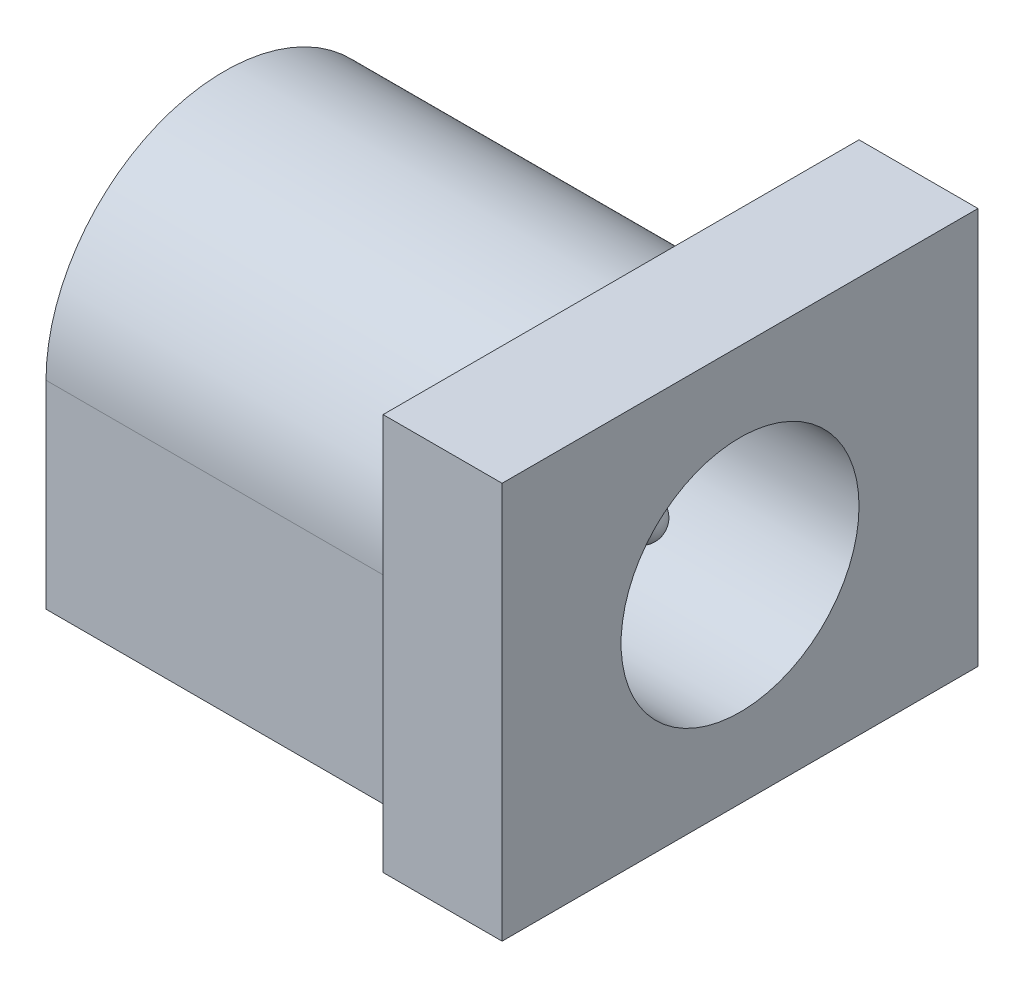
ISO-10303-21;
HEADER;
FILE_DESCRIPTION(('STEP AP214'),'2;1');
FILE_NAME('part.step','',(''),(''),'','','');
FILE_SCHEMA(('AUTOMOTIVE_DESIGN { 1 0 10303 214 1 1 1 1 }'));
ENDSEC;
DATA;
#1=APPLICATION_CONTEXT('core data for automotive mechanical design processes');
#2=APPLICATION_PROTOCOL_DEFINITION('international standard','automotive_design',2000,#1);
#3=PRODUCT_CONTEXT('',#1,'mechanical');
#4=PRODUCT('Part','Part','',(#3));
#5=PRODUCT_RELATED_PRODUCT_CATEGORY('part','',(#4));
#6=PRODUCT_DEFINITION_FORMATION('','',#4);
#7=PRODUCT_DEFINITION_CONTEXT('part definition',#1,'design');
#8=PRODUCT_DEFINITION('design','',#6,#7);
#9=PRODUCT_DEFINITION_SHAPE('','',#8);
#10=(LENGTH_UNIT() NAMED_UNIT(*) SI_UNIT(.MILLI.,.METRE.));
#11=(NAMED_UNIT(*) PLANE_ANGLE_UNIT() SI_UNIT($,.RADIAN.));
#12=(NAMED_UNIT(*) SI_UNIT($,.STERADIAN.) SOLID_ANGLE_UNIT());
#13=UNCERTAINTY_MEASURE_WITH_UNIT(LENGTH_MEASURE(1.E-05),#10,'distance_accuracy_value','');
#14=(GEOMETRIC_REPRESENTATION_CONTEXT(3) GLOBAL_UNCERTAINTY_ASSIGNED_CONTEXT((#13)) GLOBAL_UNIT_ASSIGNED_CONTEXT((#10,
#11,#12)) REPRESENTATION_CONTEXT('',''));
#15=CARTESIAN_POINT('',(0.,0.,0.));
#16=DIRECTION('',(0.,0.,1.));
#17=DIRECTION('',(1.,0.,0.));
#18=AXIS2_PLACEMENT_3D('',#15,#16,#17);
#19=CARTESIAN_POINT('',(10.,0.,4.5));
#20=DIRECTION('',(0.,0.,-1.));
#21=DIRECTION('',(-1.,0.,0.));
#22=AXIS2_PLACEMENT_3D('',#19,#20,#21);
#23=PLANE('',#22);
#24=DIRECTION('',(0.,-1.,0.));
#25=VECTOR('',#24,1.);
#26=CARTESIAN_POINT('',(0.,0.,4.5));
#27=LINE('',#26,#25);
#28=CARTESIAN_POINT('',(0.,5.,4.5));
#29=VERTEX_POINT('',#28);
#30=CARTESIAN_POINT('',(0.,0.,4.5));
#31=VERTEX_POINT('',#30);
#32=EDGE_CURVE('E135',#29,#31,#27,.T.);
#33=ORIENTED_EDGE('',*,*,#32,.T.);
#34=DIRECTION('',(-1.,0.,0.));
#35=VECTOR('',#34,1.);
#36=CARTESIAN_POINT('',(10.,0.,4.5));
#37=LINE('',#36,#35);
#38=CARTESIAN_POINT('',(10.,0.,4.5));
#39=VERTEX_POINT('',#38);
#40=EDGE_CURVE('E44',#39,#31,#37,.T.);
#41=ORIENTED_EDGE('',*,*,#40,.F.);
#42=DIRECTION('',(0.,-1.,0.));
#43=VECTOR('',#42,1.);
#44=CARTESIAN_POINT('',(10.,0.,4.5));
#45=LINE('',#44,#43);
#46=CARTESIAN_POINT('',(10.,5.,4.5));
#47=VERTEX_POINT('',#46);
#48=EDGE_CURVE('E207',#47,#39,#45,.T.);
#49=ORIENTED_EDGE('',*,*,#48,.F.);
#50=DIRECTION('',(-1.,0.,0.));
#51=VECTOR('',#50,1.);
#52=CARTESIAN_POINT('',(10.,5.,4.5));
#53=LINE('',#52,#51);
#54=EDGE_CURVE('E206',#47,#29,#53,.T.);
#55=ORIENTED_EDGE('',*,*,#54,.T.);
#56=EDGE_LOOP('',(#33,#41,#49,#55));
#57=FACE_BOUND('',#56,.T.);
#58=ADVANCED_FACE('F35',(#57),#23,.F.);
#59=CARTESIAN_POINT('',(10.,0.,4.5));
#60=DIRECTION('',(0.,1.,0.));
#61=DIRECTION('',(0.,0.,1.));
#62=AXIS2_PLACEMENT_3D('',#59,#60,#61);
#63=PLANE('',#62);
#64=DIRECTION('',(0.,0.,-1.));
#65=VECTOR('',#64,1.);
#66=CARTESIAN_POINT('',(0.,0.,4.5));
#67=LINE('',#66,#65);
#68=CARTESIAN_POINT('',(0.,0.,-4.5));
#69=VERTEX_POINT('',#68);
#70=EDGE_CURVE('E137',#31,#69,#67,.T.);
#71=ORIENTED_EDGE('',*,*,#70,.T.);
#72=DIRECTION('',(-1.,0.,0.));
#73=VECTOR('',#72,1.);
#74=CARTESIAN_POINT('',(10.,0.,-4.5));
#75=LINE('',#74,#73);
#76=CARTESIAN_POINT('',(10.,0.,-4.5));
#77=VERTEX_POINT('',#76);
#78=EDGE_CURVE('E210',#77,#69,#75,.T.);
#79=ORIENTED_EDGE('',*,*,#78,.F.);
#80=DIRECTION('',(0.,0.,-1.));
#81=VECTOR('',#80,1.);
#82=CARTESIAN_POINT('',(10.,0.,6.));
#83=LINE('',#82,#81);
#84=CARTESIAN_POINT('',(10.,0.,-6.));
#85=VERTEX_POINT('',#84);
#86=EDGE_CURVE('E147',#77,#85,#83,.T.);
#87=ORIENTED_EDGE('',*,*,#86,.T.);
#88=DIRECTION('',(-1.,0.,0.));
#89=VECTOR('',#88,1.);
#90=CARTESIAN_POINT('',(13.,0.,-6.));
#91=LINE('',#90,#89);
#92=CARTESIAN_POINT('',(13.,0.,-6.));
#93=VERTEX_POINT('',#92);
#94=EDGE_CURVE('E117',#93,#85,#91,.T.);
#95=ORIENTED_EDGE('',*,*,#94,.F.);
#96=DIRECTION('',(0.,0.,-1.));
#97=VECTOR('',#96,1.);
#98=CARTESIAN_POINT('',(13.,0.,6.));
#99=LINE('',#98,#97);
#100=CARTESIAN_POINT('',(13.,0.,6.));
#101=VERTEX_POINT('',#100);
#102=EDGE_CURVE('E109',#101,#93,#99,.T.);
#103=ORIENTED_EDGE('',*,*,#102,.F.);
#104=DIRECTION('',(-1.,0.,0.));
#105=VECTOR('',#104,1.);
#106=CARTESIAN_POINT('',(13.,0.,6.));
#107=LINE('',#106,#105);
#108=CARTESIAN_POINT('',(10.,0.,6.));
#109=VERTEX_POINT('',#108);
#110=EDGE_CURVE('E114',#101,#109,#107,.T.);
#111=ORIENTED_EDGE('',*,*,#110,.T.);
#112=EDGE_CURVE('E143',#109,#39,#83,.T.);
#113=ORIENTED_EDGE('',*,*,#112,.T.);
#114=ORIENTED_EDGE('',*,*,#40,.T.);
#115=EDGE_LOOP('',(#71,#79,#87,#95,#103,#111,#113,#114));
#116=FACE_BOUND('',#115,.T.);
#117=ADVANCED_FACE('F111',(#116),#63,.F.);
#118=CARTESIAN_POINT('',(10.,0.,-4.5));
#119=DIRECTION('',(0.,0.,1.));
#120=DIRECTION('',(1.,0.,0.));
#121=AXIS2_PLACEMENT_3D('',#118,#119,#120);
#122=PLANE('',#121);
#123=DIRECTION('',(0.,1.,0.));
#124=VECTOR('',#123,1.);
#125=CARTESIAN_POINT('',(0.,0.,-4.5));
#126=LINE('',#125,#124);
#127=CARTESIAN_POINT('',(0.,5.,-4.5));
#128=VERTEX_POINT('',#127);
#129=EDGE_CURVE('E68',#69,#128,#126,.T.);
#130=ORIENTED_EDGE('',*,*,#129,.T.);
#131=DIRECTION('',(-1.,0.,0.));
#132=VECTOR('',#131,1.);
#133=CARTESIAN_POINT('',(10.,5.,-4.5));
#134=LINE('',#133,#132);
#135=CARTESIAN_POINT('',(10.,5.,-4.5));
#136=VERTEX_POINT('',#135);
#137=EDGE_CURVE('E52',#136,#128,#134,.T.);
#138=ORIENTED_EDGE('',*,*,#137,.F.);
#139=DIRECTION('',(0.,1.,0.));
#140=VECTOR('',#139,1.);
#141=CARTESIAN_POINT('',(10.,0.,-4.5));
#142=LINE('',#141,#140);
#143=EDGE_CURVE('E212',#77,#136,#142,.T.);
#144=ORIENTED_EDGE('',*,*,#143,.F.);
#145=ORIENTED_EDGE('',*,*,#78,.T.);
#146=EDGE_LOOP('',(#130,#138,#144,#145));
#147=FACE_BOUND('',#146,.T.);
#148=ADVANCED_FACE('F193',(#147),#122,.F.);
#149=CARTESIAN_POINT('',(10.,5.,0.));
#150=DIRECTION('',(-1.,0.,0.));
#151=DIRECTION('',(0.,0.,1.));
#152=AXIS2_PLACEMENT_3D('',#149,#150,#151);
#153=CYLINDRICAL_SURFACE('',#152,4.5);
#154=CARTESIAN_POINT('',(0.,5.,0.));
#155=DIRECTION('',(1.,0.,0.));
#156=DIRECTION('',(0.,0.,1.));
#157=AXIS2_PLACEMENT_3D('',#154,#155,#156);
#158=CIRCLE('',#157,4.5);
#159=EDGE_CURVE('E73',#128,#29,#158,.T.);
#160=ORIENTED_EDGE('',*,*,#159,.T.);
#161=ORIENTED_EDGE('',*,*,#54,.F.);
#162=CARTESIAN_POINT('',(10.,5.,0.));
#163=DIRECTION('',(1.,0.,0.));
#164=DIRECTION('',(0.,0.,1.));
#165=AXIS2_PLACEMENT_3D('',#162,#163,#164);
#166=CIRCLE('',#165,4.5);
#167=EDGE_CURVE('E208',#136,#47,#166,.T.);
#168=ORIENTED_EDGE('',*,*,#167,.F.);
#169=ORIENTED_EDGE('',*,*,#137,.T.);
#170=EDGE_LOOP('',(#160,#161,#168,#169));
#171=FACE_BOUND('',#170,.T.);
#172=ADVANCED_FACE('F198',(#171),#153,.T.);
#173=CARTESIAN_POINT('',(0.,5.,0.));
#174=DIRECTION('',(-1.,0.,0.));
#175=DIRECTION('',(0.,0.,1.));
#176=AXIS2_PLACEMENT_3D('',#173,#174,#175);
#177=PLANE('',#176);
#178=ORIENTED_EDGE('',*,*,#32,.F.);
#179=ORIENTED_EDGE('',*,*,#159,.F.);
#180=ORIENTED_EDGE('',*,*,#129,.F.);
#181=ORIENTED_EDGE('',*,*,#70,.F.);
#182=EDGE_LOOP('',(#178,#179,#180,#181));
#183=FACE_BOUND('',#182,.T.);
#184=ADVANCED_FACE('F187',(#183),#177,.T.);
#185=CARTESIAN_POINT('',(13.,0.,6.));
#186=DIRECTION('',(0.,0.,-1.));
#187=DIRECTION('',(-1.,0.,0.));
#188=AXIS2_PLACEMENT_3D('',#185,#186,#187);
#189=PLANE('',#188);
#190=DIRECTION('',(0.,-1.,0.));
#191=VECTOR('',#190,1.);
#192=CARTESIAN_POINT('',(10.,0.,6.));
#193=LINE('',#192,#191);
#194=CARTESIAN_POINT('',(10.,10.,6.));
#195=VERTEX_POINT('',#194);
#196=EDGE_CURVE('E134',#195,#109,#193,.T.);
#197=ORIENTED_EDGE('',*,*,#196,.T.);
#198=ORIENTED_EDGE('',*,*,#110,.F.);
#199=DIRECTION('',(0.,-1.,0.));
#200=VECTOR('',#199,1.);
#201=CARTESIAN_POINT('',(13.,0.,6.));
#202=LINE('',#201,#200);
#203=CARTESIAN_POINT('',(13.,10.,6.));
#204=VERTEX_POINT('',#203);
#205=EDGE_CURVE('E121',#204,#101,#202,.T.);
#206=ORIENTED_EDGE('',*,*,#205,.F.);
#207=DIRECTION('',(-1.,0.,0.));
#208=VECTOR('',#207,1.);
#209=CARTESIAN_POINT('',(13.,10.,6.));
#210=LINE('',#209,#208);
#211=EDGE_CURVE('E156',#204,#195,#210,.T.);
#212=ORIENTED_EDGE('',*,*,#211,.T.);
#213=EDGE_LOOP('',(#197,#198,#206,#212));
#214=FACE_BOUND('',#213,.T.);
#215=ADVANCED_FACE('F132',(#214),#189,.F.);
#216=CARTESIAN_POINT('',(13.,0.,-6.));
#217=DIRECTION('',(0.,0.,1.));
#218=DIRECTION('',(1.,0.,0.));
#219=AXIS2_PLACEMENT_3D('',#216,#217,#218);
#220=PLANE('',#219);
#221=DIRECTION('',(0.,1.,0.));
#222=VECTOR('',#221,1.);
#223=CARTESIAN_POINT('',(10.,0.,-6.));
#224=LINE('',#223,#222);
#225=CARTESIAN_POINT('',(10.,10.,-6.));
#226=VERTEX_POINT('',#225);
#227=EDGE_CURVE('E146',#85,#226,#224,.T.);
#228=ORIENTED_EDGE('',*,*,#227,.T.);
#229=DIRECTION('',(-1.,0.,0.));
#230=VECTOR('',#229,1.);
#231=CARTESIAN_POINT('',(13.,10.,-6.));
#232=LINE('',#231,#230);
#233=CARTESIAN_POINT('',(13.,10.,-6.));
#234=VERTEX_POINT('',#233);
#235=EDGE_CURVE('E139',#234,#226,#232,.T.);
#236=ORIENTED_EDGE('',*,*,#235,.F.);
#237=DIRECTION('',(0.,1.,0.));
#238=VECTOR('',#237,1.);
#239=CARTESIAN_POINT('',(13.,0.,-6.));
#240=LINE('',#239,#238);
#241=EDGE_CURVE('E120',#93,#234,#240,.T.);
#242=ORIENTED_EDGE('',*,*,#241,.F.);
#243=ORIENTED_EDGE('',*,*,#94,.T.);
#244=EDGE_LOOP('',(#228,#236,#242,#243));
#245=FACE_BOUND('',#244,.T.);
#246=ADVANCED_FACE('F179',(#245),#220,.F.);
#247=CARTESIAN_POINT('',(13.,10.,6.));
#248=DIRECTION('',(0.,-1.,0.));
#249=DIRECTION('',(0.,0.,-1.));
#250=AXIS2_PLACEMENT_3D('',#247,#248,#249);
#251=PLANE('',#250);
#252=DIRECTION('',(0.,0.,1.));
#253=VECTOR('',#252,1.);
#254=CARTESIAN_POINT('',(10.,10.,6.));
#255=LINE('',#254,#253);
#256=EDGE_CURVE('E130',#226,#195,#255,.T.);
#257=ORIENTED_EDGE('',*,*,#256,.T.);
#258=ORIENTED_EDGE('',*,*,#211,.F.);
#259=DIRECTION('',(0.,0.,1.));
#260=VECTOR('',#259,1.);
#261=CARTESIAN_POINT('',(13.,10.,6.));
#262=LINE('',#261,#260);
#263=EDGE_CURVE('E126',#234,#204,#262,.T.);
#264=ORIENTED_EDGE('',*,*,#263,.F.);
#265=ORIENTED_EDGE('',*,*,#235,.T.);
#266=EDGE_LOOP('',(#257,#258,#264,#265));
#267=FACE_BOUND('',#266,.T.);
#268=ADVANCED_FACE('F161',(#267),#251,.F.);
#269=CARTESIAN_POINT('',(13.,0.,0.));
#270=DIRECTION('',(-1.,0.,0.));
#271=DIRECTION('',(0.,0.,1.));
#272=AXIS2_PLACEMENT_3D('',#269,#270,#271);
#273=PLANE('',#272);
#274=CARTESIAN_POINT('',(13.,5.,0.));
#275=DIRECTION('',(1.,0.,0.));
#276=DIRECTION('',(0.,0.,-1.));
#277=AXIS2_PLACEMENT_3D('',#274,#275,#276);
#278=CIRCLE('',#277,3.);
#279=CARTESIAN_POINT('',(13.,5.,-3.));
#280=VERTEX_POINT('',#279);
#281=EDGE_CURVE('E170',#280,#280,#278,.T.);
#282=ORIENTED_EDGE('',*,*,#281,.F.);
#283=EDGE_LOOP('',(#282));
#284=FACE_BOUND('',#283,.T.);
#285=ORIENTED_EDGE('',*,*,#205,.T.);
#286=ORIENTED_EDGE('',*,*,#102,.T.);
#287=ORIENTED_EDGE('',*,*,#241,.T.);
#288=ORIENTED_EDGE('',*,*,#263,.T.);
#289=EDGE_LOOP('',(#285,#286,#287,#288));
#290=FACE_BOUND('',#289,.T.);
#291=ADVANCED_FACE('F124',(#284,#290),#273,.F.);
#292=CARTESIAN_POINT('',(10.,0.,0.));
#293=DIRECTION('',(-1.,0.,0.));
#294=DIRECTION('',(0.,0.,1.));
#295=AXIS2_PLACEMENT_3D('',#292,#293,#294);
#296=PLANE('',#295);
#297=ORIENTED_EDGE('',*,*,#167,.T.);
#298=ORIENTED_EDGE('',*,*,#48,.T.);
#299=ORIENTED_EDGE('',*,*,#112,.F.);
#300=ORIENTED_EDGE('',*,*,#196,.F.);
#301=ORIENTED_EDGE('',*,*,#256,.F.);
#302=ORIENTED_EDGE('',*,*,#227,.F.);
#303=ORIENTED_EDGE('',*,*,#86,.F.);
#304=ORIENTED_EDGE('',*,*,#143,.T.);
#305=EDGE_LOOP('',(#297,#298,#299,#300,#301,#302,#303,#304));
#306=FACE_BOUND('',#305,.T.);
#307=ADVANCED_FACE('F166',(#306),#296,.T.);
#308=CARTESIAN_POINT('',(1.,5.,0.));
#309=DIRECTION('',(1.,0.,0.));
#310=DIRECTION('',(0.,0.,-1.));
#311=AXIS2_PLACEMENT_3D('',#308,#309,#310);
#312=CYLINDRICAL_SURFACE('',#311,3.);
#313=CARTESIAN_POINT('',(1.,5.,0.));
#314=DIRECTION('',(1.,0.,0.));
#315=DIRECTION('',(0.,0.,-1.));
#316=AXIS2_PLACEMENT_3D('',#313,#314,#315);
#317=CIRCLE('',#316,3.);
#318=CARTESIAN_POINT('',(1.,5.,-3.));
#319=VERTEX_POINT('',#318);
#320=EDGE_CURVE('E168',#319,#319,#317,.T.);
#321=ORIENTED_EDGE('',*,*,#320,.F.);
#322=EDGE_LOOP('',(#321));
#323=FACE_BOUND('',#322,.T.);
#324=ORIENTED_EDGE('',*,*,#281,.T.);
#325=EDGE_LOOP('',(#324));
#326=FACE_BOUND('',#325,.T.);
#327=ADVANCED_FACE('F259',(#323,#326),#312,.F.);
#328=CARTESIAN_POINT('',(1.,5.,0.));
#329=DIRECTION('',(1.,0.,0.));
#330=DIRECTION('',(0.,0.,-1.));
#331=AXIS2_PLACEMENT_3D('',#328,#329,#330);
#332=PLANE('',#331);
#333=CARTESIAN_POINT('',(1.,5.,0.));
#334=DIRECTION('',(1.,0.,0.));
#335=DIRECTION('',(0.,0.,-1.));
#336=AXIS2_PLACEMENT_3D('',#333,#334,#335);
#337=CIRCLE('',#336,0.5);
#338=CARTESIAN_POINT('',(1.,5.,-0.5));
#339=VERTEX_POINT('',#338);
#340=EDGE_CURVE('E175',#339,#339,#337,.T.);
#341=ORIENTED_EDGE('',*,*,#340,.F.);
#342=EDGE_LOOP('',(#341));
#343=FACE_BOUND('',#342,.T.);
#344=ORIENTED_EDGE('',*,*,#320,.T.);
#345=EDGE_LOOP('',(#344));
#346=FACE_BOUND('',#345,.T.);
#347=ADVANCED_FACE('F275',(#343,#346),#332,.T.);
#348=CARTESIAN_POINT('',(11.,5.,0.));
#349=DIRECTION('',(-1.,0.,0.));
#350=DIRECTION('',(0.,0.,1.));
#351=AXIS2_PLACEMENT_3D('',#348,#349,#350);
#352=CYLINDRICAL_SURFACE('',#351,0.5);
#353=CARTESIAN_POINT('',(10.5,5.,0.));
#354=DIRECTION('',(-1.,0.,0.));
#355=DIRECTION('',(0.,0.,1.));
#356=AXIS2_PLACEMENT_3D('',#353,#354,#355);
#357=CIRCLE('',#356,0.5);
#358=CARTESIAN_POINT('',(10.5,5.,0.5));
#359=VERTEX_POINT('',#358);
#360=EDGE_CURVE('E11',#359,#359,#357,.T.);
#361=ORIENTED_EDGE('',*,*,#360,.T.);
#362=EDGE_LOOP('',(#361));
#363=FACE_BOUND('',#362,.T.);
#364=ORIENTED_EDGE('',*,*,#340,.T.);
#365=EDGE_LOOP('',(#364));
#366=FACE_BOUND('',#365,.T.);
#367=ADVANCED_FACE('F285',(#363,#366),#352,.T.);
#368=CARTESIAN_POINT('',(10.5,5.,0.));
#369=DIRECTION('',(1.,0.,0.));
#370=DIRECTION('',(0.,0.,-1.));
#371=AXIS2_PLACEMENT_3D('',#368,#369,#370);
#372=SPHERICAL_SURFACE('',#371,0.5);
#373=ORIENTED_EDGE('',*,*,#360,.F.);
#374=EDGE_LOOP('',(#373));
#375=FACE_BOUND('',#374,.T.);
#376=ADVANCED_FACE('F37',(#375),#372,.T.);
#377=CLOSED_SHELL('',(#58,#117,#148,#172,#184,#215,#246,#268,#291,#307,#327,#347,#367,#376));
#378=MANIFOLD_SOLID_BREP('B2',#377);
#379=ADVANCED_BREP_SHAPE_REPRESENTATION('',(#18,#378),#14);
#380=SHAPE_DEFINITION_REPRESENTATION(#9,#379);
ENDSEC;
END-ISO-10303-21;
